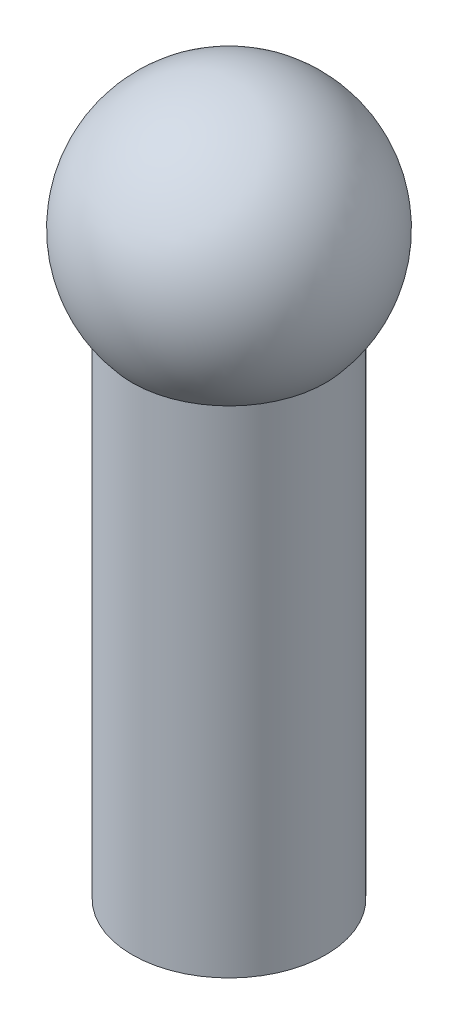
ISO-10303-21;
HEADER;
FILE_DESCRIPTION(('STEP AP214'),'2;1');
FILE_NAME('part.step','',(''),(''),'','','');
FILE_SCHEMA(('AUTOMOTIVE_DESIGN { 1 0 10303 214 1 1 1 1 }'));
ENDSEC;
DATA;
#1=APPLICATION_CONTEXT('core data for automotive mechanical design processes');
#2=APPLICATION_PROTOCOL_DEFINITION('international standard','automotive_design',2000,#1);
#3=PRODUCT_CONTEXT('',#1,'mechanical');
#4=PRODUCT('Part','Part','',(#3));
#5=PRODUCT_RELATED_PRODUCT_CATEGORY('part','',(#4));
#6=PRODUCT_DEFINITION_FORMATION('','',#4);
#7=PRODUCT_DEFINITION_CONTEXT('part definition',#1,'design');
#8=PRODUCT_DEFINITION('design','',#6,#7);
#9=PRODUCT_DEFINITION_SHAPE('','',#8);
#10=(LENGTH_UNIT() NAMED_UNIT(*) SI_UNIT(.MILLI.,.METRE.));
#11=(NAMED_UNIT(*) PLANE_ANGLE_UNIT() SI_UNIT($,.RADIAN.));
#12=(NAMED_UNIT(*) SI_UNIT($,.STERADIAN.) SOLID_ANGLE_UNIT());
#13=UNCERTAINTY_MEASURE_WITH_UNIT(LENGTH_MEASURE(1.E-05),#10,'distance_accuracy_value','');
#14=(GEOMETRIC_REPRESENTATION_CONTEXT(3) GLOBAL_UNCERTAINTY_ASSIGNED_CONTEXT((#13)) GLOBAL_UNIT_ASSIGNED_CONTEXT((#10,
#11,#12)) REPRESENTATION_CONTEXT('',''));
#15=CARTESIAN_POINT('',(0.,0.,0.));
#16=DIRECTION('',(0.,0.,1.));
#17=DIRECTION('',(1.,0.,0.));
#18=AXIS2_PLACEMENT_3D('',#15,#16,#17);
#19=CARTESIAN_POINT('',(0.,9.,0.));
#20=DIRECTION('',(1.,0.,0.));
#21=DIRECTION('',(0.,0.,1.));
#22=AXIS2_PLACEMENT_3D('',#19,#20,#21);
#23=SPHERICAL_SURFACE('',#22,2.);
#24=CARTESIAN_POINT('',(0.,9.,0.));
#25=DIRECTION('',(0.,1.,0.));
#26=DIRECTION('',(0.,0.,1.));
#27=AXIS2_PLACEMENT_3D('',#24,#25,#26);
#28=SPHERICAL_SURFACE('',#27,2.);
#29=CARTESIAN_POINT('',(0.,7.67712434446771,0.));
#30=DIRECTION('',(0.,1.,0.));
#31=DIRECTION('',(0.,0.,1.));
#32=AXIS2_PLACEMENT_3D('',#29,#30,#31);
#33=CIRCLE('',#32,1.5);
#34=CARTESIAN_POINT('',(0.,7.67712434446771,1.5));
#35=VERTEX_POINT('',#34);
#36=EDGE_CURVE('E47',#35,#35,#33,.F.);
#37=ORIENTED_EDGE('',*,*,#36,.F.);
#38=EDGE_LOOP('',(#37));
#39=FACE_BOUND('',#38,.T.);
#40=ADVANCED_FACE('F43',(#39),#28,.T.);
#41=CARTESIAN_POINT('',(0.,9.,0.));
#42=DIRECTION('',(0.,-1.,0.));
#43=DIRECTION('',(0.,0.,-1.));
#44=AXIS2_PLACEMENT_3D('',#41,#42,#43);
#45=CYLINDRICAL_SURFACE('',#44,1.5);
#46=ORIENTED_EDGE('',*,*,#36,.T.);
#47=EDGE_LOOP('',(#46));
#48=FACE_BOUND('',#47,.T.);
#49=CARTESIAN_POINT('',(0.,0.,0.));
#50=DIRECTION('',(0.,1.,0.));
#51=DIRECTION('',(0.,0.,1.));
#52=AXIS2_PLACEMENT_3D('',#49,#50,#51);
#53=CIRCLE('',#52,1.5);
#54=CARTESIAN_POINT('',(0.,0.,1.5));
#55=VERTEX_POINT('',#54);
#56=EDGE_CURVE('E10',#55,#55,#53,.T.);
#57=ORIENTED_EDGE('',*,*,#56,.T.);
#58=EDGE_LOOP('',(#57));
#59=FACE_BOUND('',#58,.T.);
#60=ADVANCED_FACE('F45',(#48,#59),#45,.T.);
#61=CARTESIAN_POINT('',(0.,0.,0.));
#62=DIRECTION('',(0.,1.,0.));
#63=DIRECTION('',(0.,0.,1.));
#64=AXIS2_PLACEMENT_3D('',#61,#62,#63);
#65=PLANE('',#64);
#66=ORIENTED_EDGE('',*,*,#56,.F.);
#67=EDGE_LOOP('',(#66));
#68=FACE_BOUND('',#67,.T.);
#69=ADVANCED_FACE('F65',(#68),#65,.F.);
#70=CLOSED_SHELL('',(#40,#60,#69));
#71=MANIFOLD_SOLID_BREP('B2',#70);
#72=ADVANCED_BREP_SHAPE_REPRESENTATION('',(#18,#71),#14);
#73=SHAPE_DEFINITION_REPRESENTATION(#9,#72);
ENDSEC;
END-ISO-10303-21;
